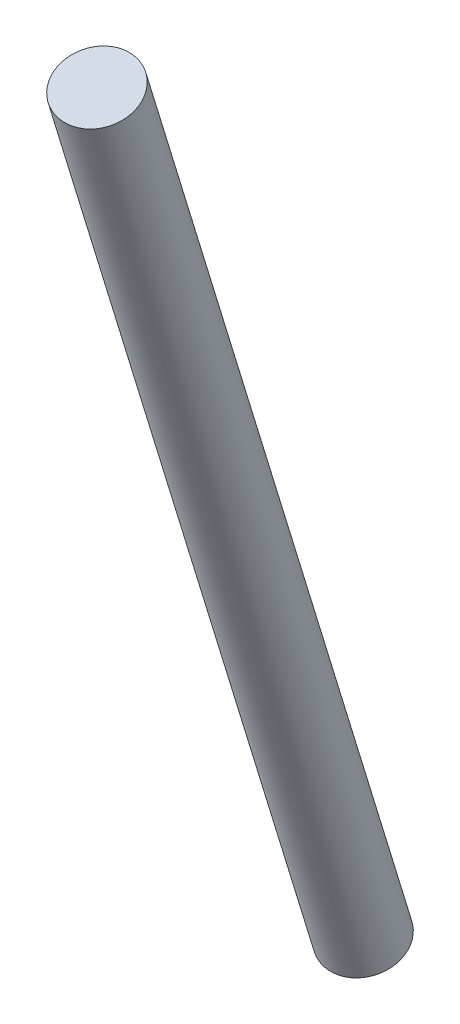
ISO-10303-21;
HEADER;
FILE_DESCRIPTION(('STEP AP214'),'2;1');
FILE_NAME('part.step','',(''),(''),'','','');
FILE_SCHEMA(('AUTOMOTIVE_DESIGN { 1 0 10303 214 1 1 1 1 }'));
ENDSEC;
DATA;
#1=APPLICATION_CONTEXT('core data for automotive mechanical design processes');
#2=APPLICATION_PROTOCOL_DEFINITION('international standard','automotive_design',2000,#1);
#3=PRODUCT_CONTEXT('',#1,'mechanical');
#4=PRODUCT('Part','Part','',(#3));
#5=PRODUCT_RELATED_PRODUCT_CATEGORY('part','',(#4));
#6=PRODUCT_DEFINITION_FORMATION('','',#4);
#7=PRODUCT_DEFINITION_CONTEXT('part definition',#1,'design');
#8=PRODUCT_DEFINITION('design','',#6,#7);
#9=PRODUCT_DEFINITION_SHAPE('','',#8);
#10=(LENGTH_UNIT() NAMED_UNIT(*) SI_UNIT(.MILLI.,.METRE.));
#11=(NAMED_UNIT(*) PLANE_ANGLE_UNIT() SI_UNIT($,.RADIAN.));
#12=(NAMED_UNIT(*) SI_UNIT($,.STERADIAN.) SOLID_ANGLE_UNIT());
#13=UNCERTAINTY_MEASURE_WITH_UNIT(LENGTH_MEASURE(1.E-05),#10,'distance_accuracy_value','');
#14=(GEOMETRIC_REPRESENTATION_CONTEXT(3) GLOBAL_UNCERTAINTY_ASSIGNED_CONTEXT((#13)) GLOBAL_UNIT_ASSIGNED_CONTEXT((#10,
#11,#12)) REPRESENTATION_CONTEXT('',''));
#15=CARTESIAN_POINT('',(0.,0.,0.));
#16=DIRECTION('',(0.,0.,1.));
#17=DIRECTION('',(1.,0.,0.));
#18=AXIS2_PLACEMENT_3D('',#15,#16,#17);
#19=CARTESIAN_POINT('',(164.278526781237,112.063669757386,175.582551715229));
#20=DIRECTION('',(0.0908869428853984,0.93273972634626,0.348907102977925));
#21=DIRECTION('',(0.,-0.350357155200277,0.936616177417393));
#22=AXIS2_PLACEMENT_3D('',#19,#20,#21);
#23=PLANE('',#22);
#24=CARTESIAN_POINT('',(164.278526781237,112.063669757386,175.582551715229));
#25=DIRECTION('',(0.0908869428853984,0.93273972634626,0.348907102977925));
#26=DIRECTION('',(0.,-0.350357155200277,0.936616177417393));
#27=AXIS2_PLACEMENT_3D('',#24,#25,#26);
#28=CIRCLE('',#27,17.145);
#29=CARTESIAN_POINT('',(164.278526781237,106.056796331479,191.640836077051));
#30=VERTEX_POINT('',#29);
#31=EDGE_CURVE('E57',#30,#30,#28,.T.);
#32=ORIENTED_EDGE('',*,*,#31,.F.);
#33=EDGE_LOOP('',(#32));
#34=FACE_BOUND('',#33,.T.);
#35=ADVANCED_FACE('F50',(#34),#23,.F.);
#36=CARTESIAN_POINT('',(208.728526781237,568.237895887643,346.222252369747));
#37=DIRECTION('',(0.0908869428853984,0.93273972634626,0.348907102977925));
#38=DIRECTION('',(0.,-0.350357155200277,0.936616177417393));
#39=AXIS2_PLACEMENT_3D('',#36,#37,#38);
#40=PLANE('',#39);
#41=CARTESIAN_POINT('',(208.728526781237,568.237895887643,346.222252369747));
#42=DIRECTION('',(0.0908869428853984,0.93273972634626,0.348907102977925));
#43=DIRECTION('',(0.,-0.350357155200277,0.936616177417393));
#44=AXIS2_PLACEMENT_3D('',#41,#42,#43);
#45=CIRCLE('',#44,17.145);
#46=CARTESIAN_POINT('',(208.728526781237,562.231022461734,362.28053673157));
#47=VERTEX_POINT('',#46);
#48=EDGE_CURVE('E14',#47,#47,#45,.T.);
#49=ORIENTED_EDGE('',*,*,#48,.T.);
#50=EDGE_LOOP('',(#49));
#51=FACE_BOUND('',#50,.T.);
#52=ADVANCED_FACE('F64',(#51),#40,.T.);
#53=CARTESIAN_POINT('',(164.278526781237,112.063669757386,175.582551715229));
#54=DIRECTION('',(0.0908869428853986,0.93273972634626,0.348907102977925));
#55=DIRECTION('',(0.,-0.350357155200277,0.936616177417393));
#56=AXIS2_PLACEMENT_3D('',#53,#54,#55);
#57=CYLINDRICAL_SURFACE('',#56,17.145);
#58=ORIENTED_EDGE('',*,*,#48,.F.);
#59=EDGE_LOOP('',(#58));
#60=FACE_BOUND('',#59,.T.);
#61=ORIENTED_EDGE('',*,*,#31,.T.);
#62=EDGE_LOOP('',(#61));
#63=FACE_BOUND('',#62,.T.);
#64=ADVANCED_FACE('F66',(#60,#63),#57,.T.);
#65=CLOSED_SHELL('',(#35,#52,#64));
#66=MANIFOLD_SOLID_BREP('B2',#65);
#67=ADVANCED_BREP_SHAPE_REPRESENTATION('',(#18,#66),#14);
#68=SHAPE_DEFINITION_REPRESENTATION(#9,#67);
ENDSEC;
END-ISO-10303-21;
